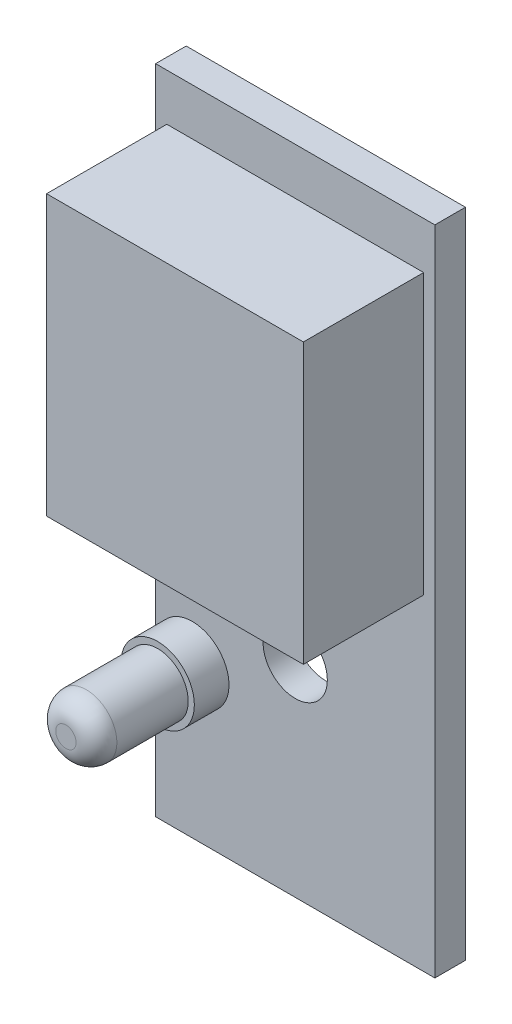
ISO-10303-21;
HEADER;
FILE_DESCRIPTION(('STEP AP214'),'2;1');
FILE_NAME('part.step','',(''),(''),'','','');
FILE_SCHEMA(('AUTOMOTIVE_DESIGN { 1 0 10303 214 1 1 1 1 }'));
ENDSEC;
DATA;
#1=APPLICATION_CONTEXT('core data for automotive mechanical design processes');
#2=APPLICATION_PROTOCOL_DEFINITION('international standard','automotive_design',2000,#1);
#3=PRODUCT_CONTEXT('',#1,'mechanical');
#4=PRODUCT('Part','Part','',(#3));
#5=PRODUCT_RELATED_PRODUCT_CATEGORY('part','',(#4));
#6=PRODUCT_DEFINITION_FORMATION('','',#4);
#7=PRODUCT_DEFINITION_CONTEXT('part definition',#1,'design');
#8=PRODUCT_DEFINITION('design','',#6,#7);
#9=PRODUCT_DEFINITION_SHAPE('','',#8);
#10=(LENGTH_UNIT() NAMED_UNIT(*) SI_UNIT(.MILLI.,.METRE.));
#11=(NAMED_UNIT(*) PLANE_ANGLE_UNIT() SI_UNIT($,.RADIAN.));
#12=(NAMED_UNIT(*) SI_UNIT($,.STERADIAN.) SOLID_ANGLE_UNIT());
#13=UNCERTAINTY_MEASURE_WITH_UNIT(LENGTH_MEASURE(1.E-05),#10,'distance_accuracy_value','');
#14=(GEOMETRIC_REPRESENTATION_CONTEXT(3) GLOBAL_UNCERTAINTY_ASSIGNED_CONTEXT((#13)) GLOBAL_UNIT_ASSIGNED_CONTEXT((#10,
#11,#12)) REPRESENTATION_CONTEXT('',''));
#15=CARTESIAN_POINT('',(0.,0.,0.));
#16=DIRECTION('',(0.,0.,1.));
#17=DIRECTION('',(1.,0.,0.));
#18=AXIS2_PLACEMENT_3D('',#15,#16,#17);
#19=CARTESIAN_POINT('',(6.84999999999999,16.,1.5));
#20=DIRECTION('',(-1.,0.,0.));
#21=DIRECTION('',(0.,-1.,0.));
#22=AXIS2_PLACEMENT_3D('',#19,#20,#21);
#23=PLANE('',#22);
#24=DIRECTION('',(0.,1.,0.));
#25=VECTOR('',#24,1.);
#26=CARTESIAN_POINT('',(6.84999999999999,16.,0.));
#27=LINE('',#26,#25);
#28=CARTESIAN_POINT('',(6.85,-16.,0.));
#29=VERTEX_POINT('',#28);
#30=CARTESIAN_POINT('',(6.84999999999999,16.,0.));
#31=VERTEX_POINT('',#30);
#32=EDGE_CURVE('E132',#29,#31,#27,.T.);
#33=ORIENTED_EDGE('',*,*,#32,.T.);
#34=DIRECTION('',(0.,0.,-1.));
#35=VECTOR('',#34,1.);
#36=CARTESIAN_POINT('',(6.84999999999999,16.,1.5));
#37=LINE('',#36,#35);
#38=CARTESIAN_POINT('',(6.84999999999999,16.,1.5));
#39=VERTEX_POINT('',#38);
#40=EDGE_CURVE('E166',#39,#31,#37,.T.);
#41=ORIENTED_EDGE('',*,*,#40,.F.);
#42=DIRECTION('',(0.,1.,0.));
#43=VECTOR('',#42,1.);
#44=CARTESIAN_POINT('',(6.84999999999999,16.,1.5));
#45=LINE('',#44,#43);
#46=CARTESIAN_POINT('',(6.85,-16.,1.5));
#47=VERTEX_POINT('',#46);
#48=EDGE_CURVE('E141',#47,#39,#45,.T.);
#49=ORIENTED_EDGE('',*,*,#48,.F.);
#50=DIRECTION('',(0.,0.,-1.));
#51=VECTOR('',#50,1.);
#52=CARTESIAN_POINT('',(6.85,-16.,1.5));
#53=LINE('',#52,#51);
#54=EDGE_CURVE('E152',#47,#29,#53,.T.);
#55=ORIENTED_EDGE('',*,*,#54,.T.);
#56=EDGE_LOOP('',(#33,#41,#49,#55));
#57=FACE_BOUND('',#56,.T.);
#58=ADVANCED_FACE('F42',(#57),#23,.F.);
#59=CARTESIAN_POINT('',(-6.85,16.,1.5));
#60=DIRECTION('',(0.,-1.,0.));
#61=DIRECTION('',(0.,0.,-1.));
#62=AXIS2_PLACEMENT_3D('',#59,#60,#61);
#63=PLANE('',#62);
#64=DIRECTION('',(-1.,0.,0.));
#65=VECTOR('',#64,1.);
#66=CARTESIAN_POINT('',(-6.85,16.,0.));
#67=LINE('',#66,#65);
#68=CARTESIAN_POINT('',(-6.85,16.,0.));
#69=VERTEX_POINT('',#68);
#70=EDGE_CURVE('E135',#31,#69,#67,.T.);
#71=ORIENTED_EDGE('',*,*,#70,.T.);
#72=DIRECTION('',(0.,0.,-1.));
#73=VECTOR('',#72,1.);
#74=CARTESIAN_POINT('',(-6.85,16.,1.5));
#75=LINE('',#74,#73);
#76=CARTESIAN_POINT('',(-6.85,16.,1.5));
#77=VERTEX_POINT('',#76);
#78=EDGE_CURVE('E163',#77,#69,#75,.T.);
#79=ORIENTED_EDGE('',*,*,#78,.F.);
#80=DIRECTION('',(-1.,0.,0.));
#81=VECTOR('',#80,1.);
#82=CARTESIAN_POINT('',(-6.85,16.,1.5));
#83=LINE('',#82,#81);
#84=EDGE_CURVE('E144',#39,#77,#83,.T.);
#85=ORIENTED_EDGE('',*,*,#84,.F.);
#86=ORIENTED_EDGE('',*,*,#40,.T.);
#87=EDGE_LOOP('',(#71,#79,#85,#86));
#88=FACE_BOUND('',#87,.T.);
#89=ADVANCED_FACE('F224',(#88),#63,.F.);
#90=CARTESIAN_POINT('',(-6.85,16.,1.5));
#91=DIRECTION('',(1.,0.,0.));
#92=DIRECTION('',(0.,1.,0.));
#93=AXIS2_PLACEMENT_3D('',#90,#91,#92);
#94=PLANE('',#93);
#95=DIRECTION('',(0.,-1.,0.));
#96=VECTOR('',#95,1.);
#97=CARTESIAN_POINT('',(-6.85,16.,0.));
#98=LINE('',#97,#96);
#99=CARTESIAN_POINT('',(-6.85,-16.,0.));
#100=VERTEX_POINT('',#99);
#101=EDGE_CURVE('E155',#69,#100,#98,.T.);
#102=ORIENTED_EDGE('',*,*,#101,.T.);
#103=DIRECTION('',(0.,0.,-1.));
#104=VECTOR('',#103,1.);
#105=CARTESIAN_POINT('',(-6.85,-16.,1.5));
#106=LINE('',#105,#104);
#107=CARTESIAN_POINT('',(-6.85,-16.,1.5));
#108=VERTEX_POINT('',#107);
#109=EDGE_CURVE('E160',#108,#100,#106,.T.);
#110=ORIENTED_EDGE('',*,*,#109,.F.);
#111=DIRECTION('',(0.,-1.,0.));
#112=VECTOR('',#111,1.);
#113=CARTESIAN_POINT('',(-6.85,16.,1.5));
#114=LINE('',#113,#112);
#115=CARTESIAN_POINT('',(-6.85,-8.6,1.5));
#116=VERTEX_POINT('',#115);
#117=EDGE_CURVE('E147',#116,#108,#114,.T.);
#118=ORIENTED_EDGE('',*,*,#117,.F.);
#119=EDGE_CURVE('E148',#77,#116,#114,.T.);
#120=ORIENTED_EDGE('',*,*,#119,.F.);
#121=ORIENTED_EDGE('',*,*,#78,.T.);
#122=EDGE_LOOP('',(#102,#110,#118,#120,#121));
#123=FACE_BOUND('',#122,.T.);
#124=ADVANCED_FACE('F212',(#123),#94,.F.);
#125=CARTESIAN_POINT('',(-6.85,-16.,1.5));
#126=DIRECTION('',(0.,1.,0.));
#127=DIRECTION('',(0.,0.,1.));
#128=AXIS2_PLACEMENT_3D('',#125,#126,#127);
#129=PLANE('',#128);
#130=DIRECTION('',(1.,0.,0.));
#131=VECTOR('',#130,1.);
#132=CARTESIAN_POINT('',(-6.85,-16.,0.));
#133=LINE('',#132,#131);
#134=EDGE_CURVE('E145',#100,#29,#133,.T.);
#135=ORIENTED_EDGE('',*,*,#134,.T.);
#136=ORIENTED_EDGE('',*,*,#54,.F.);
#137=DIRECTION('',(1.,0.,0.));
#138=VECTOR('',#137,1.);
#139=CARTESIAN_POINT('',(-6.85,-16.,1.5));
#140=LINE('',#139,#138);
#141=EDGE_CURVE('E151',#108,#47,#140,.T.);
#142=ORIENTED_EDGE('',*,*,#141,.F.);
#143=ORIENTED_EDGE('',*,*,#109,.T.);
#144=EDGE_LOOP('',(#135,#136,#142,#143));
#145=FACE_BOUND('',#144,.T.);
#146=ADVANCED_FACE('F205',(#145),#129,.F.);
#147=CARTESIAN_POINT('',(0.,0.,1.5));
#148=DIRECTION('',(0.,0.,1.));
#149=DIRECTION('',(1.,0.,0.));
#150=AXIS2_PLACEMENT_3D('',#147,#148,#149);
#151=PLANE('',#150);
#152=CARTESIAN_POINT('',(0.,-5.975,1.5));
#153=DIRECTION('',(0.,0.,1.));
#154=DIRECTION('',(1.,0.,0.));
#155=AXIS2_PLACEMENT_3D('',#152,#153,#154);
#156=CIRCLE('',#155,1.575);
#157=CARTESIAN_POINT('',(1.575,-5.975,1.5));
#158=VERTEX_POINT('',#157);
#159=EDGE_CURVE('E178',#158,#158,#156,.T.);
#160=ORIENTED_EDGE('',*,*,#159,.F.);
#161=EDGE_LOOP('',(#160));
#162=FACE_BOUND('',#161,.T.);
#163=DIRECTION('',(-1.,0.,0.));
#164=VECTOR('',#163,1.);
#165=CARTESIAN_POINT('',(-6.3,13.7,1.5));
#166=LINE('',#165,#164);
#167=CARTESIAN_POINT('',(6.29999999999999,13.7,1.5));
#168=VERTEX_POINT('',#167);
#169=CARTESIAN_POINT('',(-6.3,13.7,1.5));
#170=VERTEX_POINT('',#169);
#171=EDGE_CURVE('E62',#168,#170,#166,.T.);
#172=ORIENTED_EDGE('',*,*,#171,.F.);
#173=DIRECTION('',(0.,1.,0.));
#174=VECTOR('',#173,1.);
#175=CARTESIAN_POINT('',(6.29999999999999,13.7,1.5));
#176=LINE('',#175,#174);
#177=CARTESIAN_POINT('',(6.29999999999999,0.,1.5));
#178=VERTEX_POINT('',#177);
#179=EDGE_CURVE('E129',#178,#168,#176,.T.);
#180=ORIENTED_EDGE('',*,*,#179,.F.);
#181=DIRECTION('',(1.,0.,0.));
#182=VECTOR('',#181,1.);
#183=CARTESIAN_POINT('',(6.29999999999999,0.,1.5));
#184=LINE('',#183,#182);
#185=CARTESIAN_POINT('',(-6.3,0.,1.5));
#186=VERTEX_POINT('',#185);
#187=EDGE_CURVE('E191',#186,#178,#184,.T.);
#188=ORIENTED_EDGE('',*,*,#187,.F.);
#189=DIRECTION('',(0.,-1.,0.));
#190=VECTOR('',#189,1.);
#191=CARTESIAN_POINT('',(-6.3,0.,1.5));
#192=LINE('',#191,#190);
#193=EDGE_CURVE('E189',#170,#186,#192,.T.);
#194=ORIENTED_EDGE('',*,*,#193,.F.);
#195=EDGE_LOOP('',(#172,#180,#188,#194));
#196=FACE_BOUND('',#195,.T.);
#197=ORIENTED_EDGE('',*,*,#119,.T.);
#198=CARTESIAN_POINT('',(-5.05000000000001,-8.6,1.5));
#199=DIRECTION('',(0.,0.,1.));
#200=DIRECTION('',(1.,0.,0.));
#201=AXIS2_PLACEMENT_3D('',#198,#199,#200);
#202=CIRCLE('',#201,1.8);
#203=EDGE_CURVE('E55',#116,#116,#202,.T.);
#204=ORIENTED_EDGE('',*,*,#203,.F.);
#205=ORIENTED_EDGE('',*,*,#117,.T.);
#206=ORIENTED_EDGE('',*,*,#141,.T.);
#207=ORIENTED_EDGE('',*,*,#48,.T.);
#208=ORIENTED_EDGE('',*,*,#84,.T.);
#209=EDGE_LOOP('',(#197,#204,#205,#206,#207,#208));
#210=FACE_BOUND('',#209,.T.);
#211=ADVANCED_FACE('F201',(#162,#196,#210),#151,.T.);
#212=CARTESIAN_POINT('',(0.,0.,0.));
#213=DIRECTION('',(0.,0.,1.));
#214=DIRECTION('',(1.,0.,0.));
#215=AXIS2_PLACEMENT_3D('',#212,#213,#214);
#216=PLANE('',#215);
#217=CARTESIAN_POINT('',(0.,-5.975,0.));
#218=DIRECTION('',(0.,0.,1.));
#219=DIRECTION('',(1.,0.,0.));
#220=AXIS2_PLACEMENT_3D('',#217,#218,#219);
#221=CIRCLE('',#220,1.575);
#222=CARTESIAN_POINT('',(1.575,-5.975,0.));
#223=VERTEX_POINT('',#222);
#224=EDGE_CURVE('E183',#223,#223,#221,.T.);
#225=ORIENTED_EDGE('',*,*,#224,.T.);
#226=EDGE_LOOP('',(#225));
#227=FACE_BOUND('',#226,.T.);
#228=ORIENTED_EDGE('',*,*,#32,.F.);
#229=ORIENTED_EDGE('',*,*,#134,.F.);
#230=ORIENTED_EDGE('',*,*,#101,.F.);
#231=ORIENTED_EDGE('',*,*,#70,.F.);
#232=EDGE_LOOP('',(#228,#229,#230,#231));
#233=FACE_BOUND('',#232,.T.);
#234=ADVANCED_FACE('F204',(#227,#233),#216,.F.);
#235=CARTESIAN_POINT('',(-6.3,13.7,7.4));
#236=DIRECTION('',(0.,-1.,0.));
#237=DIRECTION('',(0.,0.,-1.));
#238=AXIS2_PLACEMENT_3D('',#235,#236,#237);
#239=PLANE('',#238);
#240=ORIENTED_EDGE('',*,*,#171,.T.);
#241=DIRECTION('',(0.,0.,-1.));
#242=VECTOR('',#241,1.);
#243=CARTESIAN_POINT('',(-6.3,13.7,7.4));
#244=LINE('',#243,#242);
#245=CARTESIAN_POINT('',(-6.3,13.7,7.4));
#246=VERTEX_POINT('',#245);
#247=EDGE_CURVE('E114',#246,#170,#244,.T.);
#248=ORIENTED_EDGE('',*,*,#247,.F.);
#249=DIRECTION('',(-1.,0.,0.));
#250=VECTOR('',#249,1.);
#251=CARTESIAN_POINT('',(-6.3,13.7,7.4));
#252=LINE('',#251,#250);
#253=CARTESIAN_POINT('',(6.29999999999999,13.7,7.4));
#254=VERTEX_POINT('',#253);
#255=EDGE_CURVE('E120',#254,#246,#252,.T.);
#256=ORIENTED_EDGE('',*,*,#255,.F.);
#257=DIRECTION('',(0.,0.,-1.));
#258=VECTOR('',#257,1.);
#259=CARTESIAN_POINT('',(6.29999999999999,13.7,7.4));
#260=LINE('',#259,#258);
#261=EDGE_CURVE('E187',#254,#168,#260,.T.);
#262=ORIENTED_EDGE('',*,*,#261,.T.);
#263=EDGE_LOOP('',(#240,#248,#256,#262));
#264=FACE_BOUND('',#263,.T.);
#265=ADVANCED_FACE('F131',(#264),#239,.F.);
#266=CARTESIAN_POINT('',(-6.3,0.,7.4));
#267=DIRECTION('',(1.,0.,0.));
#268=DIRECTION('',(0.,0.,-1.));
#269=AXIS2_PLACEMENT_3D('',#266,#267,#268);
#270=PLANE('',#269);
#271=ORIENTED_EDGE('',*,*,#193,.T.);
#272=DIRECTION('',(0.,0.,-1.));
#273=VECTOR('',#272,1.);
#274=CARTESIAN_POINT('',(-6.3,0.,7.4));
#275=LINE('',#274,#273);
#276=CARTESIAN_POINT('',(-6.3,0.,7.4));
#277=VERTEX_POINT('',#276);
#278=EDGE_CURVE('E116',#277,#186,#275,.T.);
#279=ORIENTED_EDGE('',*,*,#278,.F.);
#280=DIRECTION('',(0.,-1.,0.));
#281=VECTOR('',#280,1.);
#282=CARTESIAN_POINT('',(-6.3,0.,7.4));
#283=LINE('',#282,#281);
#284=EDGE_CURVE('E109',#246,#277,#283,.T.);
#285=ORIENTED_EDGE('',*,*,#284,.F.);
#286=ORIENTED_EDGE('',*,*,#247,.T.);
#287=EDGE_LOOP('',(#271,#279,#285,#286));
#288=FACE_BOUND('',#287,.T.);
#289=ADVANCED_FACE('F112',(#288),#270,.F.);
#290=CARTESIAN_POINT('',(6.29999999999999,0.,7.4));
#291=DIRECTION('',(0.,1.,0.));
#292=DIRECTION('',(-1.,0.,0.));
#293=AXIS2_PLACEMENT_3D('',#290,#291,#292);
#294=PLANE('',#293);
#295=ORIENTED_EDGE('',*,*,#187,.T.);
#296=DIRECTION('',(0.,0.,-1.));
#297=VECTOR('',#296,1.);
#298=CARTESIAN_POINT('',(6.29999999999999,0.,7.4));
#299=LINE('',#298,#297);
#300=CARTESIAN_POINT('',(6.29999999999999,0.,7.4));
#301=VERTEX_POINT('',#300);
#302=EDGE_CURVE('E137',#301,#178,#299,.T.);
#303=ORIENTED_EDGE('',*,*,#302,.F.);
#304=DIRECTION('',(1.,0.,0.));
#305=VECTOR('',#304,1.);
#306=CARTESIAN_POINT('',(6.29999999999999,0.,7.4));
#307=LINE('',#306,#305);
#308=EDGE_CURVE('E119',#277,#301,#307,.T.);
#309=ORIENTED_EDGE('',*,*,#308,.F.);
#310=ORIENTED_EDGE('',*,*,#278,.T.);
#311=EDGE_LOOP('',(#295,#303,#309,#310));
#312=FACE_BOUND('',#311,.T.);
#313=ADVANCED_FACE('F200',(#312),#294,.F.);
#314=CARTESIAN_POINT('',(6.29999999999999,13.7,7.4));
#315=DIRECTION('',(-1.,0.,0.));
#316=DIRECTION('',(0.,-1.,0.));
#317=AXIS2_PLACEMENT_3D('',#314,#315,#316);
#318=PLANE('',#317);
#319=ORIENTED_EDGE('',*,*,#179,.T.);
#320=ORIENTED_EDGE('',*,*,#261,.F.);
#321=DIRECTION('',(0.,1.,0.));
#322=VECTOR('',#321,1.);
#323=CARTESIAN_POINT('',(6.29999999999999,13.7,7.4));
#324=LINE('',#323,#322);
#325=EDGE_CURVE('E125',#301,#254,#324,.T.);
#326=ORIENTED_EDGE('',*,*,#325,.F.);
#327=ORIENTED_EDGE('',*,*,#302,.T.);
#328=EDGE_LOOP('',(#319,#320,#326,#327));
#329=FACE_BOUND('',#328,.T.);
#330=ADVANCED_FACE('F198',(#329),#318,.F.);
#331=CARTESIAN_POINT('',(0.,0.,7.4));
#332=DIRECTION('',(0.,0.,-1.));
#333=DIRECTION('',(-1.,0.,0.));
#334=AXIS2_PLACEMENT_3D('',#331,#332,#333);
#335=PLANE('',#334);
#336=ORIENTED_EDGE('',*,*,#255,.T.);
#337=ORIENTED_EDGE('',*,*,#284,.T.);
#338=ORIENTED_EDGE('',*,*,#308,.T.);
#339=ORIENTED_EDGE('',*,*,#325,.T.);
#340=EDGE_LOOP('',(#336,#337,#338,#339));
#341=FACE_BOUND('',#340,.T.);
#342=ADVANCED_FACE('F123',(#341),#335,.F.);
#343=CARTESIAN_POINT('',(-5.05000000000001,-8.6,3.2));
#344=DIRECTION('',(0.,0.,-1.));
#345=DIRECTION('',(-1.,0.,0.));
#346=AXIS2_PLACEMENT_3D('',#343,#344,#345);
#347=CYLINDRICAL_SURFACE('',#346,1.8);
#348=CARTESIAN_POINT('',(-5.05000000000001,-8.6,3.2));
#349=DIRECTION('',(0.,0.,1.));
#350=DIRECTION('',(1.,0.,0.));
#351=AXIS2_PLACEMENT_3D('',#348,#349,#350);
#352=CIRCLE('',#351,1.8);
#353=CARTESIAN_POINT('',(-3.25000000000001,-8.6,3.2));
#354=VERTEX_POINT('',#353);
#355=EDGE_CURVE('E180',#354,#354,#352,.T.);
#356=ORIENTED_EDGE('',*,*,#355,.F.);
#357=EDGE_LOOP('',(#356));
#358=FACE_BOUND('',#357,.T.);
#359=ORIENTED_EDGE('',*,*,#203,.T.);
#360=EDGE_LOOP('',(#359));
#361=FACE_BOUND('',#360,.T.);
#362=ADVANCED_FACE('F271',(#358,#361),#347,.T.);
#363=CARTESIAN_POINT('',(-5.05000000000001,-8.6,3.2));
#364=DIRECTION('',(0.,0.,1.));
#365=DIRECTION('',(1.,0.,0.));
#366=AXIS2_PLACEMENT_3D('',#363,#364,#365);
#367=PLANE('',#366);
#368=CARTESIAN_POINT('',(-5.05000000000001,-8.6,3.2));
#369=DIRECTION('',(0.,0.,1.));
#370=DIRECTION('',(1.,0.,0.));
#371=AXIS2_PLACEMENT_3D('',#368,#369,#370);
#372=CIRCLE('',#371,1.5);
#373=CARTESIAN_POINT('',(-3.55000000000001,-8.6,3.2));
#374=VERTEX_POINT('',#373);
#375=EDGE_CURVE('E168',#374,#374,#372,.T.);
#376=ORIENTED_EDGE('',*,*,#375,.F.);
#377=EDGE_LOOP('',(#376));
#378=FACE_BOUND('',#377,.T.);
#379=ORIENTED_EDGE('',*,*,#355,.T.);
#380=EDGE_LOOP('',(#379));
#381=FACE_BOUND('',#380,.T.);
#382=ADVANCED_FACE('F276',(#378,#381),#367,.T.);
#383=CARTESIAN_POINT('',(-5.05000000000001,-8.6,7.7));
#384=DIRECTION('',(0.,0.,-1.));
#385=DIRECTION('',(-1.,0.,0.));
#386=AXIS2_PLACEMENT_3D('',#383,#384,#385);
#387=CYLINDRICAL_SURFACE('',#386,1.5);
#388=CARTESIAN_POINT('',(-5.05000000000001,-8.6,6.7));
#389=DIRECTION('',(0.,0.,1.));
#390=DIRECTION('',(1.,0.,0.));
#391=AXIS2_PLACEMENT_3D('',#388,#389,#390);
#392=CIRCLE('',#391,1.5);
#393=CARTESIAN_POINT('',(-3.55000000000001,-8.6,6.7));
#394=VERTEX_POINT('',#393);
#395=EDGE_CURVE('E11',#394,#394,#392,.F.);
#396=ORIENTED_EDGE('',*,*,#395,.T.);
#397=EDGE_LOOP('',(#396));
#398=FACE_BOUND('',#397,.T.);
#399=ORIENTED_EDGE('',*,*,#375,.T.);
#400=EDGE_LOOP('',(#399));
#401=FACE_BOUND('',#400,.T.);
#402=ADVANCED_FACE('F285',(#398,#401),#387,.T.);
#403=CARTESIAN_POINT('',(-5.05000000000001,-8.6,7.7));
#404=DIRECTION('',(0.,0.,1.));
#405=DIRECTION('',(1.,0.,0.));
#406=AXIS2_PLACEMENT_3D('',#403,#404,#405);
#407=PLANE('',#406);
#408=CARTESIAN_POINT('',(-5.05000000000001,-8.6,7.7));
#409=DIRECTION('',(0.,0.,1.));
#410=DIRECTION('',(1.,0.,0.));
#411=AXIS2_PLACEMENT_3D('',#408,#409,#410);
#412=CIRCLE('',#411,0.5);
#413=CARTESIAN_POINT('',(-4.55000000000001,-8.6,7.7));
#414=VERTEX_POINT('',#413);
#415=EDGE_CURVE('E50',#414,#414,#412,.T.);
#416=ORIENTED_EDGE('',*,*,#415,.T.);
#417=EDGE_LOOP('',(#416));
#418=FACE_BOUND('',#417,.T.);
#419=ADVANCED_FACE('F263',(#418),#407,.T.);
#420=CARTESIAN_POINT('',(-5.05000000000001,-8.6,6.7));
#421=DIRECTION('',(0.,0.,1.));
#422=DIRECTION('',(1.,0.,0.));
#423=AXIS2_PLACEMENT_3D('',#420,#421,#422);
#424=DEGENERATE_TOROIDAL_SURFACE('',#423,0.5,1.,.T.);
#425=ORIENTED_EDGE('',*,*,#395,.F.);
#426=EDGE_LOOP('',(#425));
#427=FACE_BOUND('',#426,.T.);
#428=ORIENTED_EDGE('',*,*,#415,.F.);
#429=EDGE_LOOP('',(#428));
#430=FACE_BOUND('',#429,.T.);
#431=ADVANCED_FACE('F44',(#427,#430),#424,.T.);
#432=CARTESIAN_POINT('',(0.,-5.975,0.));
#433=DIRECTION('',(0.,0.,1.));
#434=DIRECTION('',(1.,0.,0.));
#435=AXIS2_PLACEMENT_3D('',#432,#433,#434);
#436=CYLINDRICAL_SURFACE('',#435,1.575);
#437=ORIENTED_EDGE('',*,*,#224,.F.);
#438=EDGE_LOOP('',(#437));
#439=FACE_BOUND('',#438,.T.);
#440=ORIENTED_EDGE('',*,*,#159,.T.);
#441=EDGE_LOOP('',(#440));
#442=FACE_BOUND('',#441,.T.);
#443=ADVANCED_FACE('F262',(#439,#442),#436,.F.);
#444=CLOSED_SHELL('',(#58,#89,#124,#146,#211,#234,#265,#289,#313,#330,#342,#362,#382,#402,#419,
#431,#443));
#445=MANIFOLD_SOLID_BREP('B2',#444);
#446=ADVANCED_BREP_SHAPE_REPRESENTATION('',(#18,#445),#14);
#447=SHAPE_DEFINITION_REPRESENTATION(#9,#446);
ENDSEC;
END-ISO-10303-21;
